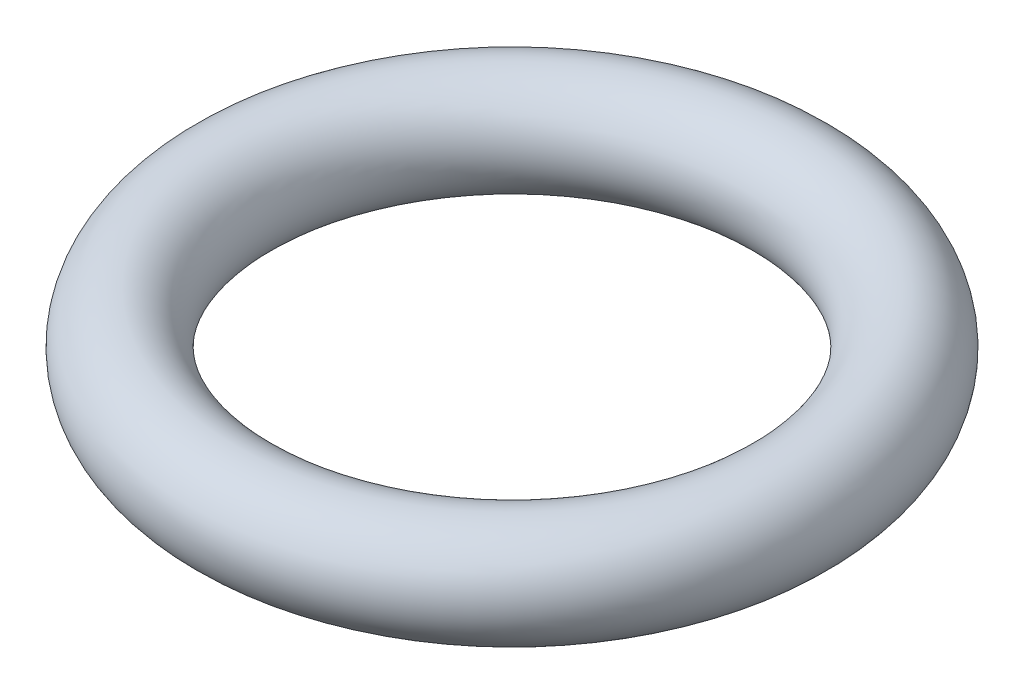
ISO-10303-21;
HEADER;
FILE_DESCRIPTION(('STEP AP214'),'2;1');
FILE_NAME('part.step','',(''),(''),'','','');
FILE_SCHEMA(('AUTOMOTIVE_DESIGN { 1 0 10303 214 1 1 1 1 }'));
ENDSEC;
DATA;
#1=APPLICATION_CONTEXT('core data for automotive mechanical design processes');
#2=APPLICATION_PROTOCOL_DEFINITION('international standard','automotive_design',2000,#1);
#3=PRODUCT_CONTEXT('',#1,'mechanical');
#4=PRODUCT('Part','Part','',(#3));
#5=PRODUCT_RELATED_PRODUCT_CATEGORY('part','',(#4));
#6=PRODUCT_DEFINITION_FORMATION('','',#4);
#7=PRODUCT_DEFINITION_CONTEXT('part definition',#1,'design');
#8=PRODUCT_DEFINITION('design','',#6,#7);
#9=PRODUCT_DEFINITION_SHAPE('','',#8);
#10=(LENGTH_UNIT() NAMED_UNIT(*) SI_UNIT(.MILLI.,.METRE.));
#11=(NAMED_UNIT(*) PLANE_ANGLE_UNIT() SI_UNIT($,.RADIAN.));
#12=(NAMED_UNIT(*) SI_UNIT($,.STERADIAN.) SOLID_ANGLE_UNIT());
#13=UNCERTAINTY_MEASURE_WITH_UNIT(LENGTH_MEASURE(1.E-05),#10,'distance_accuracy_value','');
#14=(GEOMETRIC_REPRESENTATION_CONTEXT(3) GLOBAL_UNCERTAINTY_ASSIGNED_CONTEXT((#13)) GLOBAL_UNIT_ASSIGNED_CONTEXT((#10,
#11,#12)) REPRESENTATION_CONTEXT('',''));
#15=CARTESIAN_POINT('',(0.,0.,0.));
#16=DIRECTION('',(0.,0.,1.));
#17=DIRECTION('',(1.,0.,0.));
#18=AXIS2_PLACEMENT_3D('',#15,#16,#17);
#19=CARTESIAN_POINT('',(0.,0.,0.));
#20=DIRECTION('',(0.,1.,0.));
#21=DIRECTION('',(0.,0.,1.));
#22=AXIS2_PLACEMENT_3D('',#19,#20,#21);
#23=TOROIDAL_SURFACE('',#22,4.,0.75);
#24=CARTESIAN_POINT('',(0.,0.,4.75));
#25=VERTEX_POINT('',#24);
#26=VERTEX_LOOP('',#25);
#27=FACE_BOUND('',#26,.T.);
#28=ADVANCED_FACE('F45',(#27),#23,.T.);
#29=CLOSED_SHELL('',(#28));
#30=MANIFOLD_SOLID_BREP('B2',#29);
#31=ADVANCED_BREP_SHAPE_REPRESENTATION('',(#18,#30),#14);
#32=SHAPE_DEFINITION_REPRESENTATION(#9,#31);
ENDSEC;
END-ISO-10303-21;
